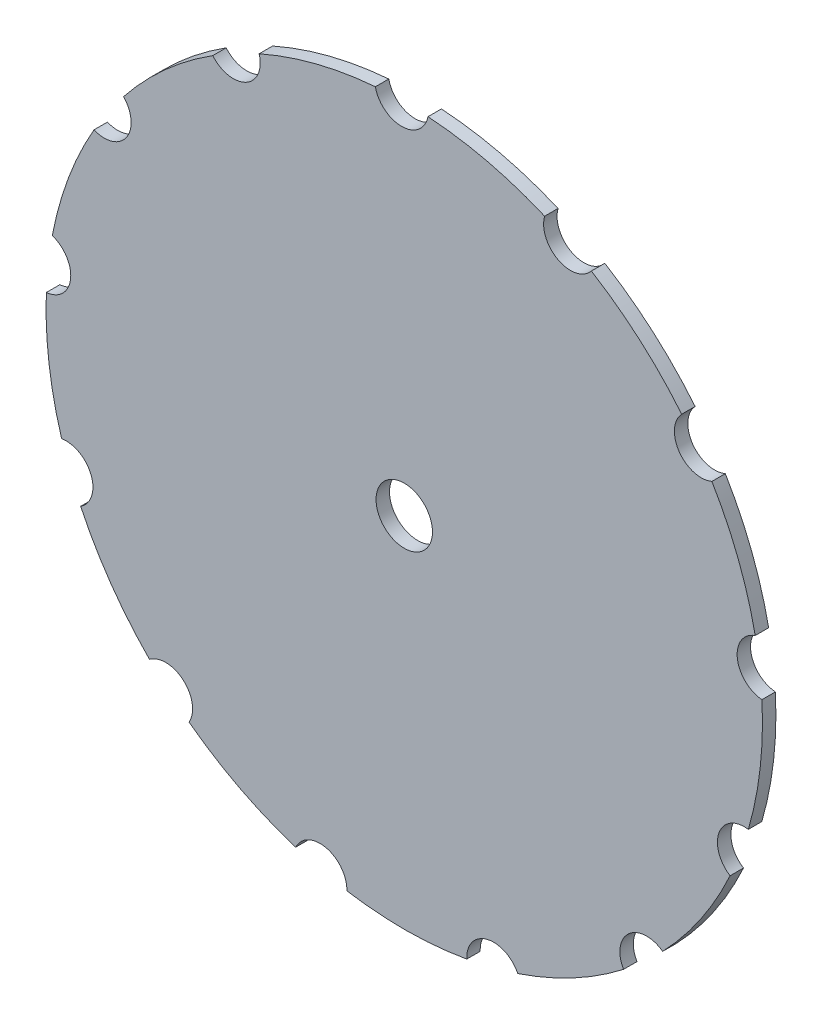
ISO-10303-21;
HEADER;
FILE_DESCRIPTION(('STEP AP214'),'2;1');
FILE_NAME('part.step','',(''),(''),'','','');
FILE_SCHEMA(('AUTOMOTIVE_DESIGN { 1 0 10303 214 1 1 1 1 }'));
ENDSEC;
DATA;
#1=APPLICATION_CONTEXT('core data for automotive mechanical design processes');
#2=APPLICATION_PROTOCOL_DEFINITION('international standard','automotive_design',2000,#1);
#3=PRODUCT_CONTEXT('',#1,'mechanical');
#4=PRODUCT('Part','Part','',(#3));
#5=PRODUCT_RELATED_PRODUCT_CATEGORY('part','',(#4));
#6=PRODUCT_DEFINITION_FORMATION('','',#4);
#7=PRODUCT_DEFINITION_CONTEXT('part definition',#1,'design');
#8=PRODUCT_DEFINITION('design','',#6,#7);
#9=PRODUCT_DEFINITION_SHAPE('','',#8);
#10=(LENGTH_UNIT() NAMED_UNIT(*) SI_UNIT(.MILLI.,.METRE.));
#11=(NAMED_UNIT(*) PLANE_ANGLE_UNIT() SI_UNIT($,.RADIAN.));
#12=(NAMED_UNIT(*) SI_UNIT($,.STERADIAN.) SOLID_ANGLE_UNIT());
#13=UNCERTAINTY_MEASURE_WITH_UNIT(LENGTH_MEASURE(1.E-05),#10,'distance_accuracy_value','');
#14=(GEOMETRIC_REPRESENTATION_CONTEXT(3) GLOBAL_UNCERTAINTY_ASSIGNED_CONTEXT((#13)) GLOBAL_UNIT_ASSIGNED_CONTEXT((#10,
#11,#12)) REPRESENTATION_CONTEXT('',''));
#15=CARTESIAN_POINT('',(0.,0.,0.));
#16=DIRECTION('',(0.,0.,1.));
#17=DIRECTION('',(1.,0.,0.));
#18=AXIS2_PLACEMENT_3D('',#15,#16,#17);
#19=CARTESIAN_POINT('',(-0.587373122348968,80.9978702980226,6.));
#20=DIRECTION('',(0.,0.,1.));
#21=DIRECTION('',(1.,0.,0.));
#22=AXIS2_PLACEMENT_3D('',#19,#20,#21);
#23=PLANE('',#22);
#24=CARTESIAN_POINT('',(0.,0.,6.));
#25=DIRECTION('',(0.,0.,1.));
#26=DIRECTION('',(1.,0.,0.));
#27=AXIS2_PLACEMENT_3D('',#24,#25,#26);
#28=CIRCLE('',#27,160.);
#29=CARTESIAN_POINT('',(62.6841029650331,147.209725342687,6.));
#30=VERTEX_POINT('',#29);
#31=CARTESIAN_POINT('',(10.5935341703109,159.648918047641,6.));
#32=VERTEX_POINT('',#31);
#33=EDGE_CURVE('E353',#30,#32,#28,.T.);
#34=ORIENTED_EDGE('',*,*,#33,.T.);
#35=CARTESIAN_POINT('',(-1.17474624469794,161.995740596045,6.));
#36=DIRECTION('',(0.,0.,-1.));
#37=DIRECTION('',(1.,0.,0.));
#38=AXIS2_PLACEMENT_3D('',#35,#36,#37);
#39=CIRCLE('',#38,11.999999999999);
#40=CARTESIAN_POINT('',(-12.9077538338865,159.478493506064,6.));
#41=VERTEX_POINT('',#40);
#42=EDGE_CURVE('E150',#32,#41,#39,.T.);
#43=ORIENTED_EDGE('',*,*,#42,.T.);
#44=CARTESIAN_POINT('',(0.,0.,6.));
#45=DIRECTION('',(0.,0.,1.));
#46=DIRECTION('',(1.,0.,0.));
#47=AXIS2_PLACEMENT_3D('',#44,#45,#46);
#48=CIRCLE('',#47,160.);
#49=CARTESIAN_POINT('',(-64.8124429443831,146.285157277084,6.));
#50=VERTEX_POINT('',#49);
#51=EDGE_CURVE('E347',#41,#50,#48,.T.);
#52=ORIENTED_EDGE('',*,*,#51,.T.);
#53=CARTESIAN_POINT('',(-76.323360568348,142.894172839742,6.));
#54=DIRECTION('',(0.,0.,-1.));
#55=DIRECTION('',(1.,0.,0.));
#56=AXIS2_PLACEMENT_3D('',#53,#54,#55);
#57=CIRCLE('',#56,12.);
#58=CARTESIAN_POINT('',(-85.5425997847584,135.2126607314,6.));
#59=VERTEX_POINT('',#58);
#60=EDGE_CURVE('E339',#50,#59,#57,.T.);
#61=ORIENTED_EDGE('',*,*,#60,.T.);
#62=CARTESIAN_POINT('',(0.,0.,6.));
#63=DIRECTION('',(0.,0.,1.));
#64=DIRECTION('',(1.,0.,0.));
#65=AXIS2_PLACEMENT_3D('',#62,#63,#64);
#66=CIRCLE('',#65,160.);
#67=CARTESIAN_POINT('',(-125.370670455135,99.4092299016034,6.));
#68=VERTEX_POINT('',#67);
#69=EDGE_CURVE('E335',#59,#68,#66,.T.);
#70=ORIENTED_EDGE('',*,*,#69,.T.);
#71=CARTESIAN_POINT('',(-133.987212781995,91.057272147319,6.));
#72=DIRECTION('',(0.,0.,-1.));
#73=DIRECTION('',(1.,0.,0.));
#74=AXIS2_PLACEMENT_3D('',#71,#72,#73);
#75=CIRCLE('',#74,11.999999999999);
#76=CARTESIAN_POINT('',(-138.580667025027,79.9712368723823,6.));
#77=VERTEX_POINT('',#76);
#78=EDGE_CURVE('E331',#68,#77,#75,.T.);
#79=ORIENTED_EDGE('',*,*,#78,.T.);
#80=CARTESIAN_POINT('',(0.,0.,6.));
#81=DIRECTION('',(0.,0.,1.));
#82=DIRECTION('',(1.,0.,0.));
#83=AXIS2_PLACEMENT_3D('',#80,#81,#82);
#84=CIRCLE('',#83,160.);
#85=CARTESIAN_POINT('',(-157.207988244983,29.7598459667596,6.));
#86=VERTEX_POINT('',#85);
#87=EDGE_CURVE('E328',#77,#86,#84,.T.);
#88=ORIENTED_EDGE('',*,*,#87,.T.);
#89=CARTESIAN_POINT('',(-160.956209268243,18.3602477650317,6.));
#90=DIRECTION('',(0.,0.,-1.));
#91=DIRECTION('',(1.,0.,0.));
#92=AXIS2_PLACEMENT_3D('',#89,#90,#91);
#93=CIRCLE('',#92,11.9999999999999);
#94=CARTESIAN_POINT('',(-159.871573527948,6.40936640377342,6.));
#95=VERTEX_POINT('',#94);
#96=EDGE_CURVE('E320',#86,#95,#93,.T.);
#97=ORIENTED_EDGE('',*,*,#96,.T.);
#98=CARTESIAN_POINT('',(0.,0.,6.));
#99=DIRECTION('',(0.,0.,1.));
#100=DIRECTION('',(1.,0.,0.));
#101=AXIS2_PLACEMENT_3D('',#98,#99,#100);
#102=CIRCLE('',#101,160.);
#103=CARTESIAN_POINT('',(-153.030850489544,-46.7071600340535,6.));
#104=VERTEX_POINT('',#103);
#105=EDGE_CURVE('E316',#95,#104,#102,.T.);
#106=ORIENTED_EDGE('',*,*,#105,.T.);
#107=CARTESIAN_POINT('',(-151.052077943734,-58.5428881152431,6.));
#108=DIRECTION('',(0.,0.,-1.));
#109=DIRECTION('',(1.,0.,0.));
#110=AXIS2_PLACEMENT_3D('',#107,#108,#109);
#111=CIRCLE('',#110,11.9999999999999);
#112=CARTESIAN_POINT('',(-144.537829196934,-68.6208126666975,6.));
#113=VERTEX_POINT('',#112);
#114=EDGE_CURVE('E312',#104,#113,#111,.T.);
#115=ORIENTED_EDGE('',*,*,#114,.T.);
#116=CARTESIAN_POINT('',(0.,0.,6.));
#117=DIRECTION('',(0.,0.,1.));
#118=DIRECTION('',(1.,0.,0.));
#119=AXIS2_PLACEMENT_3D('',#116,#117,#118);
#120=CIRCLE('',#119,160.);
#121=CARTESIAN_POINT('',(-113.796189108621,-112.474118553359,6.));
#122=VERTEX_POINT('',#121);
#123=EDGE_CURVE('E309',#113,#122,#120,.T.);
#124=ORIENTED_EDGE('',*,*,#123,.T.);
#125=CARTESIAN_POINT('',(-106.543735937192,-122.0345538466,6.));
#126=DIRECTION('',(0.,0.,-1.));
#127=DIRECTION('',(1.,0.,0.));
#128=AXIS2_PLACEMENT_3D('',#125,#126,#127);
#129=CIRCLE('',#128,12.0000000000017);
#130=CARTESIAN_POINT('',(-96.0922100665643,-127.930790525672,6.));
#131=VERTEX_POINT('',#130);
#132=EDGE_CURVE('E301',#122,#131,#129,.T.);
#133=ORIENTED_EDGE('',*,*,#132,.T.);
#134=CARTESIAN_POINT('',(0.,0.,6.));
#135=DIRECTION('',(0.,0.,1.));
#136=DIRECTION('',(1.,0.,0.));
#137=AXIS2_PLACEMENT_3D('',#134,#135,#136);
#138=CIRCLE('',#137,160.);
#139=CARTESIAN_POINT('',(-48.4921921956505,-152.474611972158,6.));
#140=VERTEX_POINT('',#139);
#141=EDGE_CURVE('E297',#131,#140,#138,.T.);
#142=ORIENTED_EDGE('',*,*,#141,.T.);
#143=CARTESIAN_POINT('',(-37.6275080186468,-157.569573967499,6.));
#144=DIRECTION('',(0.,0.,-1.));
#145=DIRECTION('',(1.,0.,0.));
#146=AXIS2_PLACEMENT_3D('',#143,#144,#145);
#147=CIRCLE('',#146,11.9999999999999);
#148=CARTESIAN_POINT('',(-25.6330236466115,-157.933366008365,6.));
#149=VERTEX_POINT('',#148);
#150=EDGE_CURVE('E293',#140,#149,#147,.T.);
#151=ORIENTED_EDGE('',*,*,#150,.T.);
#152=CARTESIAN_POINT('',(0.,0.,6.));
#153=DIRECTION('',(0.,0.,1.));
#154=DIRECTION('',(1.,0.,0.));
#155=AXIS2_PLACEMENT_3D('',#152,#153,#154);
#156=CIRCLE('',#155,160.);
#157=CARTESIAN_POINT('',(27.9207815550782,-157.5450093064,6.));
#158=VERTEX_POINT('',#157);
#159=EDGE_CURVE('E290',#149,#158,#156,.T.);
#160=ORIENTED_EDGE('',*,*,#159,.T.);
#161=CARTESIAN_POINT('',(39.9087285263425,-157.007303611659,6.));
#162=DIRECTION('',(0.,0.,-1.));
#163=DIRECTION('',(1.,0.,0.));
#164=AXIS2_PLACEMENT_3D('',#161,#162,#163);
#165=CIRCLE('',#164,12.0000000000001);
#166=CARTESIAN_POINT('',(50.6983795793594,-151.755310641925,6.));
#167=VERTEX_POINT('',#166);
#168=EDGE_CURVE('E282',#158,#167,#165,.T.);
#169=ORIENTED_EDGE('',*,*,#168,.T.);
#170=CARTESIAN_POINT('',(0.,0.,6.));
#171=DIRECTION('',(0.,0.,1.));
#172=DIRECTION('',(1.,0.,0.));
#173=AXIS2_PLACEMENT_3D('',#170,#171,#172);
#174=CIRCLE('',#173,160.);
#175=CARTESIAN_POINT('',(97.9374407334306,-126.523743631722,6.));
#176=VERTEX_POINT('',#175);
#177=EDGE_CURVE('E278',#167,#176,#174,.T.);
#178=ORIENTED_EDGE('',*,*,#177,.T.);
#179=CARTESIAN_POINT('',(108.302356318264,-120.476552141511,6.));
#180=DIRECTION('',(0.,0.,-1.));
#181=DIRECTION('',(1.,0.,0.));
#182=AXIS2_PLACEMENT_3D('',#179,#180,#181);
#183=CIRCLE('',#182,12.0000000000009);
#184=CARTESIAN_POINT('',(115.415395025404,-110.811942457165,6.));
#185=VERTEX_POINT('',#184);
#186=EDGE_CURVE('E274',#176,#185,#183,.T.);
#187=ORIENTED_EDGE('',*,*,#186,.T.);
#188=CARTESIAN_POINT('',(0.,0.,6.));
#189=DIRECTION('',(0.,0.,1.));
#190=DIRECTION('',(1.,0.,0.));
#191=AXIS2_PLACEMENT_3D('',#188,#189,#190);
#192=CIRCLE('',#191,160.);
#193=CARTESIAN_POINT('',(145.517812513859,-66.5174130674169,6.));
#194=VERTEX_POINT('',#193);
#195=EDGE_CURVE('E271',#185,#194,#192,.T.);
#196=ORIENTED_EDGE('',*,*,#195,.T.);
#197=CARTESIAN_POINT('',(151.885219462554,-56.3460744755864,6.));
#198=DIRECTION('',(0.,0.,-1.));
#199=DIRECTION('',(1.,0.,0.));
#200=AXIS2_PLACEMENT_3D('',#197,#198,#199);
#201=CIRCLE('',#200,11.9999999999987);
#202=CARTESIAN_POINT('',(153.692134377414,-44.482893684145,6.));
#203=VERTEX_POINT('',#202);
#204=EDGE_CURVE('E263',#194,#203,#201,.T.);
#205=ORIENTED_EDGE('',*,*,#204,.T.);
#206=CARTESIAN_POINT('',(0.,0.,6.));
#207=DIRECTION('',(0.,0.,1.));
#208=DIRECTION('',(1.,0.,0.));
#209=AXIS2_PLACEMENT_3D('',#206,#207,#208);
#210=CIRCLE('',#209,160.);
#211=CARTESIAN_POINT('',(159.761807127106,8.72725520889972,6.));
#212=VERTEX_POINT('',#211);
#213=EDGE_CURVE('E259',#203,#212,#210,.T.);
#214=ORIENTED_EDGE('',*,*,#213,.T.);
#215=CARTESIAN_POINT('',(160.673009243294,20.6926098088892,6.));
#216=DIRECTION('',(0.,0.,-1.));
#217=DIRECTION('',(1.,0.,0.));
#218=AXIS2_PLACEMENT_3D('',#215,#216,#217);
#219=CIRCLE('',#218,12.0000000000005);
#220=CARTESIAN_POINT('',(156.759857934566,32.036649954931,6.));
#221=VERTEX_POINT('',#220);
#222=EDGE_CURVE('E255',#212,#221,#219,.T.);
#223=ORIENTED_EDGE('',*,*,#222,.T.);
#224=CARTESIAN_POINT('',(0.,0.,6.));
#225=DIRECTION('',(0.,0.,1.));
#226=DIRECTION('',(1.,0.,0.));
#227=AXIS2_PLACEMENT_3D('',#224,#225,#226);
#228=CIRCLE('',#227,160.);
#229=CARTESIAN_POINT('',(137.406297066028,81.9726144916861,6.));
#230=VERTEX_POINT('',#229);
#231=EDGE_CURVE('E223',#221,#230,#228,.T.);
#232=ORIENTED_EDGE('',*,*,#231,.T.);
#233=CARTESIAN_POINT('',(132.652548926067,92.9908665591341,6.));
#234=DIRECTION('',(0.,0.,-1.));
#235=DIRECTION('',(1.,0.,0.));
#236=AXIS2_PLACEMENT_3D('',#233,#234,#235);
#237=CIRCLE('',#236,12.0000000000013);
#238=CARTESIAN_POINT('',(123.915787199994,101.216983172814,6.));
#239=VERTEX_POINT('',#238);
#240=EDGE_CURVE('E217',#230,#239,#237,.T.);
#241=ORIENTED_EDGE('',*,*,#240,.T.);
#242=CARTESIAN_POINT('',(0.,0.,6.));
#243=DIRECTION('',(0.,0.,1.));
#244=DIRECTION('',(1.,0.,0.));
#245=AXIS2_PLACEMENT_3D('',#242,#243,#244);
#246=CIRCLE('',#245,160.);
#247=CARTESIAN_POINT('',(83.5726602725145,136.439035671522,6.));
#248=VERTEX_POINT('',#247);
#249=EDGE_CURVE('E221',#239,#248,#246,.T.);
#250=ORIENTED_EDGE('',*,*,#249,.T.);
#251=CARTESIAN_POINT('',(74.24298828639,143.986036442111,6.));
#252=DIRECTION('',(0.,0.,-1.));
#253=DIRECTION('',(1.,0.,0.));
#254=AXIS2_PLACEMENT_3D('',#251,#252,#253);
#255=CIRCLE('',#254,11.999999999999);
#256=EDGE_CURVE('E53',#248,#30,#255,.T.);
#257=ORIENTED_EDGE('',*,*,#256,.T.);
#258=EDGE_LOOP('',(#34,#43,#52,#61,#70,#79,#88,#97,#106,#115,#124,#133,#142,#151,#160,#169,#178,
#187,#196,#205,#214,#223,#232,#241,#250,#257));
#259=FACE_BOUND('',#258,.T.);
#260=CARTESIAN_POINT('',(0.,0.,6.));
#261=DIRECTION('',(0.,0.,1.));
#262=DIRECTION('',(1.,0.,0.));
#263=AXIS2_PLACEMENT_3D('',#260,#261,#262);
#264=CIRCLE('',#263,12.6);
#265=CARTESIAN_POINT('',(12.6,0.,6.));
#266=VERTEX_POINT('',#265);
#267=EDGE_CURVE('E359',#266,#266,#264,.T.);
#268=ORIENTED_EDGE('',*,*,#267,.F.);
#269=EDGE_LOOP('',(#268));
#270=FACE_BOUND('',#269,.T.);
#271=ADVANCED_FACE('F36',(#259,#270),#23,.T.);
#272=CARTESIAN_POINT('',(-0.587373122348968,80.9978702980226,0.));
#273=DIRECTION('',(0.,0.,1.));
#274=DIRECTION('',(1.,0.,0.));
#275=AXIS2_PLACEMENT_3D('',#272,#273,#274);
#276=PLANE('',#275);
#277=CARTESIAN_POINT('',(0.,0.,0.));
#278=DIRECTION('',(0.,0.,1.));
#279=DIRECTION('',(1.,0.,0.));
#280=AXIS2_PLACEMENT_3D('',#277,#278,#279);
#281=CIRCLE('',#280,160.);
#282=CARTESIAN_POINT('',(62.6841029650331,147.209725342687,0.));
#283=VERTEX_POINT('',#282);
#284=CARTESIAN_POINT('',(10.5935341703109,159.648918047641,0.));
#285=VERTEX_POINT('',#284);
#286=EDGE_CURVE('E363',#283,#285,#281,.T.);
#287=ORIENTED_EDGE('',*,*,#286,.F.);
#288=CARTESIAN_POINT('',(74.24298828639,143.986036442111,0.));
#289=DIRECTION('',(0.,0.,-1.));
#290=DIRECTION('',(1.,0.,0.));
#291=AXIS2_PLACEMENT_3D('',#288,#289,#290);
#292=CIRCLE('',#291,11.999999999999);
#293=CARTESIAN_POINT('',(83.5726602725145,136.439035671522,0.));
#294=VERTEX_POINT('',#293);
#295=EDGE_CURVE('E142',#294,#283,#292,.T.);
#296=ORIENTED_EDGE('',*,*,#295,.F.);
#297=CARTESIAN_POINT('',(0.,0.,0.));
#298=DIRECTION('',(0.,0.,1.));
#299=DIRECTION('',(1.,0.,0.));
#300=AXIS2_PLACEMENT_3D('',#297,#298,#299);
#301=CIRCLE('',#300,160.);
#302=CARTESIAN_POINT('',(123.915787199994,101.216983172814,0.));
#303=VERTEX_POINT('',#302);
#304=EDGE_CURVE('E136',#303,#294,#301,.T.);
#305=ORIENTED_EDGE('',*,*,#304,.F.);
#306=CARTESIAN_POINT('',(132.652548926067,92.9908665591341,0.));
#307=DIRECTION('',(0.,0.,-1.));
#308=DIRECTION('',(1.,0.,0.));
#309=AXIS2_PLACEMENT_3D('',#306,#307,#308);
#310=CIRCLE('',#309,12.0000000000013);
#311=CARTESIAN_POINT('',(137.406297066028,81.9726144916861,0.));
#312=VERTEX_POINT('',#311);
#313=EDGE_CURVE('E232',#312,#303,#310,.T.);
#314=ORIENTED_EDGE('',*,*,#313,.F.);
#315=CARTESIAN_POINT('',(0.,0.,0.));
#316=DIRECTION('',(0.,0.,1.));
#317=DIRECTION('',(1.,0.,0.));
#318=AXIS2_PLACEMENT_3D('',#315,#316,#317);
#319=CIRCLE('',#318,160.);
#320=CARTESIAN_POINT('',(156.759857934566,32.036649954931,0.));
#321=VERTEX_POINT('',#320);
#322=EDGE_CURVE('E413',#321,#312,#319,.T.);
#323=ORIENTED_EDGE('',*,*,#322,.F.);
#324=CARTESIAN_POINT('',(160.673009243294,20.6926098088892,0.));
#325=DIRECTION('',(0.,0.,-1.));
#326=DIRECTION('',(1.,0.,0.));
#327=AXIS2_PLACEMENT_3D('',#324,#325,#326);
#328=CIRCLE('',#327,12.0000000000005);
#329=CARTESIAN_POINT('',(159.761807127106,8.72725520889972,0.));
#330=VERTEX_POINT('',#329);
#331=EDGE_CURVE('E411',#330,#321,#328,.T.);
#332=ORIENTED_EDGE('',*,*,#331,.F.);
#333=CARTESIAN_POINT('',(0.,0.,0.));
#334=DIRECTION('',(0.,0.,1.));
#335=DIRECTION('',(1.,0.,0.));
#336=AXIS2_PLACEMENT_3D('',#333,#334,#335);
#337=CIRCLE('',#336,160.);
#338=CARTESIAN_POINT('',(153.692134377414,-44.482893684145,0.));
#339=VERTEX_POINT('',#338);
#340=EDGE_CURVE('E409',#339,#330,#337,.T.);
#341=ORIENTED_EDGE('',*,*,#340,.F.);
#342=CARTESIAN_POINT('',(151.885219462554,-56.3460744755864,0.));
#343=DIRECTION('',(0.,0.,-1.));
#344=DIRECTION('',(1.,0.,0.));
#345=AXIS2_PLACEMENT_3D('',#342,#343,#344);
#346=CIRCLE('',#345,11.9999999999987);
#347=CARTESIAN_POINT('',(145.517812513859,-66.5174130674169,0.));
#348=VERTEX_POINT('',#347);
#349=EDGE_CURVE('E407',#348,#339,#346,.T.);
#350=ORIENTED_EDGE('',*,*,#349,.F.);
#351=CARTESIAN_POINT('',(0.,0.,0.));
#352=DIRECTION('',(0.,0.,1.));
#353=DIRECTION('',(1.,0.,0.));
#354=AXIS2_PLACEMENT_3D('',#351,#352,#353);
#355=CIRCLE('',#354,160.);
#356=CARTESIAN_POINT('',(115.415395025404,-110.811942457165,0.));
#357=VERTEX_POINT('',#356);
#358=EDGE_CURVE('E405',#357,#348,#355,.T.);
#359=ORIENTED_EDGE('',*,*,#358,.F.);
#360=CARTESIAN_POINT('',(108.302356318264,-120.476552141511,0.));
#361=DIRECTION('',(0.,0.,-1.));
#362=DIRECTION('',(1.,0.,0.));
#363=AXIS2_PLACEMENT_3D('',#360,#361,#362);
#364=CIRCLE('',#363,12.0000000000009);
#365=CARTESIAN_POINT('',(97.9374407334306,-126.523743631722,0.));
#366=VERTEX_POINT('',#365);
#367=EDGE_CURVE('E403',#366,#357,#364,.T.);
#368=ORIENTED_EDGE('',*,*,#367,.F.);
#369=CARTESIAN_POINT('',(0.,0.,0.));
#370=DIRECTION('',(0.,0.,1.));
#371=DIRECTION('',(1.,0.,0.));
#372=AXIS2_PLACEMENT_3D('',#369,#370,#371);
#373=CIRCLE('',#372,160.);
#374=CARTESIAN_POINT('',(50.6983795793594,-151.755310641925,0.));
#375=VERTEX_POINT('',#374);
#376=EDGE_CURVE('E401',#375,#366,#373,.T.);
#377=ORIENTED_EDGE('',*,*,#376,.F.);
#378=CARTESIAN_POINT('',(39.9087285263425,-157.007303611659,0.));
#379=DIRECTION('',(0.,0.,-1.));
#380=DIRECTION('',(1.,0.,0.));
#381=AXIS2_PLACEMENT_3D('',#378,#379,#380);
#382=CIRCLE('',#381,12.0000000000001);
#383=CARTESIAN_POINT('',(27.9207815550782,-157.5450093064,0.));
#384=VERTEX_POINT('',#383);
#385=EDGE_CURVE('E399',#384,#375,#382,.T.);
#386=ORIENTED_EDGE('',*,*,#385,.F.);
#387=CARTESIAN_POINT('',(0.,0.,0.));
#388=DIRECTION('',(0.,0.,1.));
#389=DIRECTION('',(1.,0.,0.));
#390=AXIS2_PLACEMENT_3D('',#387,#388,#389);
#391=CIRCLE('',#390,160.);
#392=CARTESIAN_POINT('',(-25.6330236466115,-157.933366008365,0.));
#393=VERTEX_POINT('',#392);
#394=EDGE_CURVE('E397',#393,#384,#391,.T.);
#395=ORIENTED_EDGE('',*,*,#394,.F.);
#396=CARTESIAN_POINT('',(-37.6275080186468,-157.569573967499,0.));
#397=DIRECTION('',(0.,0.,-1.));
#398=DIRECTION('',(1.,0.,0.));
#399=AXIS2_PLACEMENT_3D('',#396,#397,#398);
#400=CIRCLE('',#399,11.9999999999999);
#401=CARTESIAN_POINT('',(-48.4921921956505,-152.474611972158,0.));
#402=VERTEX_POINT('',#401);
#403=EDGE_CURVE('E395',#402,#393,#400,.T.);
#404=ORIENTED_EDGE('',*,*,#403,.F.);
#405=CARTESIAN_POINT('',(0.,0.,0.));
#406=DIRECTION('',(0.,0.,1.));
#407=DIRECTION('',(1.,0.,0.));
#408=AXIS2_PLACEMENT_3D('',#405,#406,#407);
#409=CIRCLE('',#408,160.);
#410=CARTESIAN_POINT('',(-96.0922100665643,-127.930790525672,0.));
#411=VERTEX_POINT('',#410);
#412=EDGE_CURVE('E393',#411,#402,#409,.T.);
#413=ORIENTED_EDGE('',*,*,#412,.F.);
#414=CARTESIAN_POINT('',(-106.543735937192,-122.0345538466,0.));
#415=DIRECTION('',(0.,0.,-1.));
#416=DIRECTION('',(1.,0.,0.));
#417=AXIS2_PLACEMENT_3D('',#414,#415,#416);
#418=CIRCLE('',#417,12.0000000000017);
#419=CARTESIAN_POINT('',(-113.796189108621,-112.474118553359,0.));
#420=VERTEX_POINT('',#419);
#421=EDGE_CURVE('E391',#420,#411,#418,.T.);
#422=ORIENTED_EDGE('',*,*,#421,.F.);
#423=CARTESIAN_POINT('',(0.,0.,0.));
#424=DIRECTION('',(0.,0.,1.));
#425=DIRECTION('',(1.,0.,0.));
#426=AXIS2_PLACEMENT_3D('',#423,#424,#425);
#427=CIRCLE('',#426,160.);
#428=CARTESIAN_POINT('',(-144.537829196934,-68.6208126666975,0.));
#429=VERTEX_POINT('',#428);
#430=EDGE_CURVE('E389',#429,#420,#427,.T.);
#431=ORIENTED_EDGE('',*,*,#430,.F.);
#432=CARTESIAN_POINT('',(-151.052077943734,-58.5428881152431,0.));
#433=DIRECTION('',(0.,0.,-1.));
#434=DIRECTION('',(1.,0.,0.));
#435=AXIS2_PLACEMENT_3D('',#432,#433,#434);
#436=CIRCLE('',#435,11.9999999999999);
#437=CARTESIAN_POINT('',(-153.030850489544,-46.7071600340535,0.));
#438=VERTEX_POINT('',#437);
#439=EDGE_CURVE('E387',#438,#429,#436,.T.);
#440=ORIENTED_EDGE('',*,*,#439,.F.);
#441=CARTESIAN_POINT('',(0.,0.,0.));
#442=DIRECTION('',(0.,0.,1.));
#443=DIRECTION('',(1.,0.,0.));
#444=AXIS2_PLACEMENT_3D('',#441,#442,#443);
#445=CIRCLE('',#444,160.);
#446=CARTESIAN_POINT('',(-159.871573527948,6.40936640377342,0.));
#447=VERTEX_POINT('',#446);
#448=EDGE_CURVE('E385',#447,#438,#445,.T.);
#449=ORIENTED_EDGE('',*,*,#448,.F.);
#450=CARTESIAN_POINT('',(-160.956209268243,18.3602477650317,0.));
#451=DIRECTION('',(0.,0.,-1.));
#452=DIRECTION('',(1.,0.,0.));
#453=AXIS2_PLACEMENT_3D('',#450,#451,#452);
#454=CIRCLE('',#453,11.9999999999999);
#455=CARTESIAN_POINT('',(-157.207988244983,29.7598459667596,0.));
#456=VERTEX_POINT('',#455);
#457=EDGE_CURVE('E383',#456,#447,#454,.T.);
#458=ORIENTED_EDGE('',*,*,#457,.F.);
#459=CARTESIAN_POINT('',(0.,0.,0.));
#460=DIRECTION('',(0.,0.,1.));
#461=DIRECTION('',(1.,0.,0.));
#462=AXIS2_PLACEMENT_3D('',#459,#460,#461);
#463=CIRCLE('',#462,160.);
#464=CARTESIAN_POINT('',(-138.580667025027,79.9712368723823,0.));
#465=VERTEX_POINT('',#464);
#466=EDGE_CURVE('E381',#465,#456,#463,.T.);
#467=ORIENTED_EDGE('',*,*,#466,.F.);
#468=CARTESIAN_POINT('',(-133.987212781995,91.057272147319,0.));
#469=DIRECTION('',(0.,0.,-1.));
#470=DIRECTION('',(1.,0.,0.));
#471=AXIS2_PLACEMENT_3D('',#468,#469,#470);
#472=CIRCLE('',#471,11.999999999999);
#473=CARTESIAN_POINT('',(-125.370670455135,99.4092299016034,0.));
#474=VERTEX_POINT('',#473);
#475=EDGE_CURVE('E379',#474,#465,#472,.T.);
#476=ORIENTED_EDGE('',*,*,#475,.F.);
#477=CARTESIAN_POINT('',(0.,0.,0.));
#478=DIRECTION('',(0.,0.,1.));
#479=DIRECTION('',(1.,0.,0.));
#480=AXIS2_PLACEMENT_3D('',#477,#478,#479);
#481=CIRCLE('',#480,160.);
#482=CARTESIAN_POINT('',(-85.5425997847584,135.2126607314,0.));
#483=VERTEX_POINT('',#482);
#484=EDGE_CURVE('E377',#483,#474,#481,.T.);
#485=ORIENTED_EDGE('',*,*,#484,.F.);
#486=CARTESIAN_POINT('',(-76.323360568348,142.894172839742,0.));
#487=DIRECTION('',(0.,0.,-1.));
#488=DIRECTION('',(1.,0.,0.));
#489=AXIS2_PLACEMENT_3D('',#486,#487,#488);
#490=CIRCLE('',#489,12.);
#491=CARTESIAN_POINT('',(-64.8124429443831,146.285157277084,0.));
#492=VERTEX_POINT('',#491);
#493=EDGE_CURVE('E375',#492,#483,#490,.T.);
#494=ORIENTED_EDGE('',*,*,#493,.F.);
#495=CARTESIAN_POINT('',(0.,0.,0.));
#496=DIRECTION('',(0.,0.,1.));
#497=DIRECTION('',(1.,0.,0.));
#498=AXIS2_PLACEMENT_3D('',#495,#496,#497);
#499=CIRCLE('',#498,160.);
#500=CARTESIAN_POINT('',(-12.9077538338865,159.478493506064,0.));
#501=VERTEX_POINT('',#500);
#502=EDGE_CURVE('E371',#501,#492,#499,.T.);
#503=ORIENTED_EDGE('',*,*,#502,.F.);
#504=CARTESIAN_POINT('',(-1.17474624469794,161.995740596045,0.));
#505=DIRECTION('',(0.,0.,-1.));
#506=DIRECTION('',(1.,0.,0.));
#507=AXIS2_PLACEMENT_3D('',#504,#505,#506);
#508=CIRCLE('',#507,11.999999999999);
#509=EDGE_CURVE('E367',#285,#501,#508,.T.);
#510=ORIENTED_EDGE('',*,*,#509,.F.);
#511=EDGE_LOOP('',(#287,#296,#305,#314,#323,#332,#341,#350,#359,#368,#377,#386,#395,#404,#413,
#422,#431,#440,#449,#458,#467,#476,#485,#494,#503,#510));
#512=FACE_BOUND('',#511,.T.);
#513=CARTESIAN_POINT('',(0.,0.,0.));
#514=DIRECTION('',(0.,0.,1.));
#515=DIRECTION('',(1.,0.,0.));
#516=AXIS2_PLACEMENT_3D('',#513,#514,#515);
#517=CIRCLE('',#516,12.6);
#518=CARTESIAN_POINT('',(12.6,0.,0.));
#519=VERTEX_POINT('',#518);
#520=EDGE_CURVE('E357',#519,#519,#517,.T.);
#521=ORIENTED_EDGE('',*,*,#520,.T.);
#522=EDGE_LOOP('',(#521));
#523=FACE_BOUND('',#522,.T.);
#524=ADVANCED_FACE('F488',(#512,#523),#276,.F.);
#525=CARTESIAN_POINT('',(0.,0.,6.));
#526=DIRECTION('',(0.,0.,-1.));
#527=DIRECTION('',(-1.,0.,0.));
#528=AXIS2_PLACEMENT_3D('',#525,#526,#527);
#529=CYLINDRICAL_SURFACE('',#528,160.);
#530=ORIENTED_EDGE('',*,*,#286,.T.);
#531=DIRECTION('',(0.,0.,-1.));
#532=VECTOR('',#531,1.);
#533=CARTESIAN_POINT('',(10.5935341703109,159.648918047641,6.));
#534=LINE('',#533,#532);
#535=EDGE_CURVE('E12',#32,#285,#534,.T.);
#536=ORIENTED_EDGE('',*,*,#535,.F.);
#537=ORIENTED_EDGE('',*,*,#33,.F.);
#538=DIRECTION('',(0.,0.,-1.));
#539=VECTOR('',#538,1.);
#540=CARTESIAN_POINT('',(62.6841029650331,147.209725342687,6.));
#541=LINE('',#540,#539);
#542=EDGE_CURVE('E240',#30,#283,#541,.T.);
#543=ORIENTED_EDGE('',*,*,#542,.T.);
#544=EDGE_LOOP('',(#530,#536,#537,#543));
#545=FACE_BOUND('',#544,.T.);
#546=ADVANCED_FACE('F38',(#545),#529,.T.);
#547=CARTESIAN_POINT('',(-1.17474624469794,161.995740596045,6.));
#548=DIRECTION('',(0.,0.,-1.));
#549=DIRECTION('',(-1.,0.,0.));
#550=AXIS2_PLACEMENT_3D('',#547,#548,#549);
#551=CYLINDRICAL_SURFACE('',#550,11.999999999999);
#552=ORIENTED_EDGE('',*,*,#509,.T.);
#553=DIRECTION('',(0.,0.,-1.));
#554=VECTOR('',#553,1.);
#555=CARTESIAN_POINT('',(-12.9077538338865,159.478493506064,6.));
#556=LINE('',#555,#554);
#557=EDGE_CURVE('E45',#41,#501,#556,.T.);
#558=ORIENTED_EDGE('',*,*,#557,.F.);
#559=ORIENTED_EDGE('',*,*,#42,.F.);
#560=ORIENTED_EDGE('',*,*,#535,.T.);
#561=EDGE_LOOP('',(#552,#558,#559,#560));
#562=FACE_BOUND('',#561,.T.);
#563=ADVANCED_FACE('F796',(#562),#551,.F.);
#564=CARTESIAN_POINT('',(0.,0.,6.));
#565=DIRECTION('',(0.,0.,-1.));
#566=DIRECTION('',(-1.,0.,0.));
#567=AXIS2_PLACEMENT_3D('',#564,#565,#566);
#568=CYLINDRICAL_SURFACE('',#567,160.);
#569=ORIENTED_EDGE('',*,*,#502,.T.);
#570=DIRECTION('',(0.,0.,-1.));
#571=VECTOR('',#570,1.);
#572=CARTESIAN_POINT('',(-64.8124429443831,146.285157277084,6.));
#573=LINE('',#572,#571);
#574=EDGE_CURVE('E478',#50,#492,#573,.T.);
#575=ORIENTED_EDGE('',*,*,#574,.F.);
#576=ORIENTED_EDGE('',*,*,#51,.F.);
#577=ORIENTED_EDGE('',*,*,#557,.T.);
#578=EDGE_LOOP('',(#569,#575,#576,#577));
#579=FACE_BOUND('',#578,.T.);
#580=ADVANCED_FACE('F484',(#579),#568,.T.);
#581=CARTESIAN_POINT('',(-76.323360568348,142.894172839742,6.));
#582=DIRECTION('',(0.,0.,-1.));
#583=DIRECTION('',(-1.,0.,0.));
#584=AXIS2_PLACEMENT_3D('',#581,#582,#583);
#585=CYLINDRICAL_SURFACE('',#584,12.);
#586=ORIENTED_EDGE('',*,*,#493,.T.);
#587=DIRECTION('',(0.,0.,-1.));
#588=VECTOR('',#587,1.);
#589=CARTESIAN_POINT('',(-85.5425997847584,135.2126607314,6.));
#590=LINE('',#589,#588);
#591=EDGE_CURVE('E475',#59,#483,#590,.T.);
#592=ORIENTED_EDGE('',*,*,#591,.F.);
#593=ORIENTED_EDGE('',*,*,#60,.F.);
#594=ORIENTED_EDGE('',*,*,#574,.T.);
#595=EDGE_LOOP('',(#586,#592,#593,#594));
#596=FACE_BOUND('',#595,.T.);
#597=ADVANCED_FACE('F494',(#596),#585,.F.);
#598=CARTESIAN_POINT('',(0.,0.,6.));
#599=DIRECTION('',(0.,0.,-1.));
#600=DIRECTION('',(-1.,0.,0.));
#601=AXIS2_PLACEMENT_3D('',#598,#599,#600);
#602=CYLINDRICAL_SURFACE('',#601,160.);
#603=ORIENTED_EDGE('',*,*,#484,.T.);
#604=DIRECTION('',(0.,0.,-1.));
#605=VECTOR('',#604,1.);
#606=CARTESIAN_POINT('',(-125.370670455135,99.4092299016034,6.));
#607=LINE('',#606,#605);
#608=EDGE_CURVE('E472',#68,#474,#607,.T.);
#609=ORIENTED_EDGE('',*,*,#608,.F.);
#610=ORIENTED_EDGE('',*,*,#69,.F.);
#611=ORIENTED_EDGE('',*,*,#591,.T.);
#612=EDGE_LOOP('',(#603,#609,#610,#611));
#613=FACE_BOUND('',#612,.T.);
#614=ADVANCED_FACE('F498',(#613),#602,.T.);
#615=CARTESIAN_POINT('',(-133.987212781995,91.057272147319,6.));
#616=DIRECTION('',(0.,0.,-1.));
#617=DIRECTION('',(-1.,0.,0.));
#618=AXIS2_PLACEMENT_3D('',#615,#616,#617);
#619=CYLINDRICAL_SURFACE('',#618,11.999999999999);
#620=ORIENTED_EDGE('',*,*,#475,.T.);
#621=DIRECTION('',(0.,0.,-1.));
#622=VECTOR('',#621,1.);
#623=CARTESIAN_POINT('',(-138.580667025027,79.9712368723823,6.));
#624=LINE('',#623,#622);
#625=EDGE_CURVE('E469',#77,#465,#624,.T.);
#626=ORIENTED_EDGE('',*,*,#625,.F.);
#627=ORIENTED_EDGE('',*,*,#78,.F.);
#628=ORIENTED_EDGE('',*,*,#608,.T.);
#629=EDGE_LOOP('',(#620,#626,#627,#628));
#630=FACE_BOUND('',#629,.T.);
#631=ADVANCED_FACE('F591',(#630),#619,.F.);
#632=CARTESIAN_POINT('',(0.,0.,6.));
#633=DIRECTION('',(0.,0.,-1.));
#634=DIRECTION('',(-1.,0.,0.));
#635=AXIS2_PLACEMENT_3D('',#632,#633,#634);
#636=CYLINDRICAL_SURFACE('',#635,160.);
#637=ORIENTED_EDGE('',*,*,#466,.T.);
#638=DIRECTION('',(0.,0.,-1.));
#639=VECTOR('',#638,1.);
#640=CARTESIAN_POINT('',(-157.207988244983,29.7598459667596,6.));
#641=LINE('',#640,#639);
#642=EDGE_CURVE('E466',#86,#456,#641,.T.);
#643=ORIENTED_EDGE('',*,*,#642,.F.);
#644=ORIENTED_EDGE('',*,*,#87,.F.);
#645=ORIENTED_EDGE('',*,*,#625,.T.);
#646=EDGE_LOOP('',(#637,#643,#644,#645));
#647=FACE_BOUND('',#646,.T.);
#648=ADVANCED_FACE('F588',(#647),#636,.T.);
#649=CARTESIAN_POINT('',(-160.956209268243,18.3602477650317,6.));
#650=DIRECTION('',(0.,0.,-1.));
#651=DIRECTION('',(-1.,0.,0.));
#652=AXIS2_PLACEMENT_3D('',#649,#650,#651);
#653=CYLINDRICAL_SURFACE('',#652,11.9999999999999);
#654=ORIENTED_EDGE('',*,*,#457,.T.);
#655=DIRECTION('',(0.,0.,-1.));
#656=VECTOR('',#655,1.);
#657=CARTESIAN_POINT('',(-159.871573527948,6.40936640377342,6.));
#658=LINE('',#657,#656);
#659=EDGE_CURVE('E463',#95,#447,#658,.T.);
#660=ORIENTED_EDGE('',*,*,#659,.F.);
#661=ORIENTED_EDGE('',*,*,#96,.F.);
#662=ORIENTED_EDGE('',*,*,#642,.T.);
#663=EDGE_LOOP('',(#654,#660,#661,#662));
#664=FACE_BOUND('',#663,.T.);
#665=ADVANCED_FACE('F584',(#664),#653,.F.);
#666=CARTESIAN_POINT('',(0.,0.,6.));
#667=DIRECTION('',(0.,0.,-1.));
#668=DIRECTION('',(-1.,0.,0.));
#669=AXIS2_PLACEMENT_3D('',#666,#667,#668);
#670=CYLINDRICAL_SURFACE('',#669,160.);
#671=ORIENTED_EDGE('',*,*,#448,.T.);
#672=DIRECTION('',(0.,0.,-1.));
#673=VECTOR('',#672,1.);
#674=CARTESIAN_POINT('',(-153.030850489544,-46.7071600340535,6.));
#675=LINE('',#674,#673);
#676=EDGE_CURVE('E460',#104,#438,#675,.T.);
#677=ORIENTED_EDGE('',*,*,#676,.F.);
#678=ORIENTED_EDGE('',*,*,#105,.F.);
#679=ORIENTED_EDGE('',*,*,#659,.T.);
#680=EDGE_LOOP('',(#671,#677,#678,#679));
#681=FACE_BOUND('',#680,.T.);
#682=ADVANCED_FACE('F580',(#681),#670,.T.);
#683=CARTESIAN_POINT('',(-151.052077943734,-58.5428881152431,6.));
#684=DIRECTION('',(0.,0.,-1.));
#685=DIRECTION('',(-1.,0.,0.));
#686=AXIS2_PLACEMENT_3D('',#683,#684,#685);
#687=CYLINDRICAL_SURFACE('',#686,11.9999999999999);
#688=ORIENTED_EDGE('',*,*,#439,.T.);
#689=DIRECTION('',(0.,0.,-1.));
#690=VECTOR('',#689,1.);
#691=CARTESIAN_POINT('',(-144.537829196934,-68.6208126666975,6.));
#692=LINE('',#691,#690);
#693=EDGE_CURVE('E457',#113,#429,#692,.T.);
#694=ORIENTED_EDGE('',*,*,#693,.F.);
#695=ORIENTED_EDGE('',*,*,#114,.F.);
#696=ORIENTED_EDGE('',*,*,#676,.T.);
#697=EDGE_LOOP('',(#688,#694,#695,#696));
#698=FACE_BOUND('',#697,.T.);
#699=ADVANCED_FACE('F575',(#698),#687,.F.);
#700=CARTESIAN_POINT('',(0.,0.,6.));
#701=DIRECTION('',(0.,0.,-1.));
#702=DIRECTION('',(-1.,0.,0.));
#703=AXIS2_PLACEMENT_3D('',#700,#701,#702);
#704=CYLINDRICAL_SURFACE('',#703,160.);
#705=ORIENTED_EDGE('',*,*,#430,.T.);
#706=DIRECTION('',(0.,0.,-1.));
#707=VECTOR('',#706,1.);
#708=CARTESIAN_POINT('',(-113.796189108621,-112.474118553359,6.));
#709=LINE('',#708,#707);
#710=EDGE_CURVE('E454',#122,#420,#709,.T.);
#711=ORIENTED_EDGE('',*,*,#710,.F.);
#712=ORIENTED_EDGE('',*,*,#123,.F.);
#713=ORIENTED_EDGE('',*,*,#693,.T.);
#714=EDGE_LOOP('',(#705,#711,#712,#713));
#715=FACE_BOUND('',#714,.T.);
#716=ADVANCED_FACE('F569',(#715),#704,.T.);
#717=CARTESIAN_POINT('',(-106.543735937192,-122.0345538466,6.));
#718=DIRECTION('',(0.,0.,-1.));
#719=DIRECTION('',(-1.,0.,0.));
#720=AXIS2_PLACEMENT_3D('',#717,#718,#719);
#721=CYLINDRICAL_SURFACE('',#720,12.0000000000017);
#722=ORIENTED_EDGE('',*,*,#421,.T.);
#723=DIRECTION('',(0.,0.,-1.));
#724=VECTOR('',#723,1.);
#725=CARTESIAN_POINT('',(-96.0922100665643,-127.930790525672,6.));
#726=LINE('',#725,#724);
#727=EDGE_CURVE('E451',#131,#411,#726,.T.);
#728=ORIENTED_EDGE('',*,*,#727,.F.);
#729=ORIENTED_EDGE('',*,*,#132,.F.);
#730=ORIENTED_EDGE('',*,*,#710,.T.);
#731=EDGE_LOOP('',(#722,#728,#729,#730));
#732=FACE_BOUND('',#731,.T.);
#733=ADVANCED_FACE('F565',(#732),#721,.F.);
#734=CARTESIAN_POINT('',(0.,0.,6.));
#735=DIRECTION('',(0.,0.,-1.));
#736=DIRECTION('',(-1.,0.,0.));
#737=AXIS2_PLACEMENT_3D('',#734,#735,#736);
#738=CYLINDRICAL_SURFACE('',#737,160.);
#739=ORIENTED_EDGE('',*,*,#412,.T.);
#740=DIRECTION('',(0.,0.,-1.));
#741=VECTOR('',#740,1.);
#742=CARTESIAN_POINT('',(-48.4921921956505,-152.474611972158,6.));
#743=LINE('',#742,#741);
#744=EDGE_CURVE('E448',#140,#402,#743,.T.);
#745=ORIENTED_EDGE('',*,*,#744,.F.);
#746=ORIENTED_EDGE('',*,*,#141,.F.);
#747=ORIENTED_EDGE('',*,*,#727,.T.);
#748=EDGE_LOOP('',(#739,#745,#746,#747));
#749=FACE_BOUND('',#748,.T.);
#750=ADVANCED_FACE('F560',(#749),#738,.T.);
#751=CARTESIAN_POINT('',(-37.6275080186468,-157.569573967499,6.));
#752=DIRECTION('',(0.,0.,-1.));
#753=DIRECTION('',(-1.,0.,0.));
#754=AXIS2_PLACEMENT_3D('',#751,#752,#753);
#755=CYLINDRICAL_SURFACE('',#754,11.9999999999999);
#756=ORIENTED_EDGE('',*,*,#403,.T.);
#757=DIRECTION('',(0.,0.,-1.));
#758=VECTOR('',#757,1.);
#759=CARTESIAN_POINT('',(-25.6330236466115,-157.933366008365,6.));
#760=LINE('',#759,#758);
#761=EDGE_CURVE('E445',#149,#393,#760,.T.);
#762=ORIENTED_EDGE('',*,*,#761,.F.);
#763=ORIENTED_EDGE('',*,*,#150,.F.);
#764=ORIENTED_EDGE('',*,*,#744,.T.);
#765=EDGE_LOOP('',(#756,#762,#763,#764));
#766=FACE_BOUND('',#765,.T.);
#767=ADVANCED_FACE('F554',(#766),#755,.F.);
#768=CARTESIAN_POINT('',(0.,0.,6.));
#769=DIRECTION('',(0.,0.,-1.));
#770=DIRECTION('',(-1.,0.,0.));
#771=AXIS2_PLACEMENT_3D('',#768,#769,#770);
#772=CYLINDRICAL_SURFACE('',#771,160.);
#773=ORIENTED_EDGE('',*,*,#394,.T.);
#774=DIRECTION('',(0.,0.,-1.));
#775=VECTOR('',#774,1.);
#776=CARTESIAN_POINT('',(27.9207815550782,-157.5450093064,6.));
#777=LINE('',#776,#775);
#778=EDGE_CURVE('E442',#158,#384,#777,.T.);
#779=ORIENTED_EDGE('',*,*,#778,.F.);
#780=ORIENTED_EDGE('',*,*,#159,.F.);
#781=ORIENTED_EDGE('',*,*,#761,.T.);
#782=EDGE_LOOP('',(#773,#779,#780,#781));
#783=FACE_BOUND('',#782,.T.);
#784=ADVANCED_FACE('F550',(#783),#772,.T.);
#785=CARTESIAN_POINT('',(39.9087285263425,-157.007303611659,6.));
#786=DIRECTION('',(0.,0.,-1.));
#787=DIRECTION('',(-1.,0.,0.));
#788=AXIS2_PLACEMENT_3D('',#785,#786,#787);
#789=CYLINDRICAL_SURFACE('',#788,12.0000000000001);
#790=ORIENTED_EDGE('',*,*,#385,.T.);
#791=DIRECTION('',(0.,0.,-1.));
#792=VECTOR('',#791,1.);
#793=CARTESIAN_POINT('',(50.6983795793594,-151.755310641925,6.));
#794=LINE('',#793,#792);
#795=EDGE_CURVE('E439',#167,#375,#794,.T.);
#796=ORIENTED_EDGE('',*,*,#795,.F.);
#797=ORIENTED_EDGE('',*,*,#168,.F.);
#798=ORIENTED_EDGE('',*,*,#778,.T.);
#799=EDGE_LOOP('',(#790,#796,#797,#798));
#800=FACE_BOUND('',#799,.T.);
#801=ADVANCED_FACE('F545',(#800),#789,.F.);
#802=CARTESIAN_POINT('',(0.,0.,6.));
#803=DIRECTION('',(0.,0.,-1.));
#804=DIRECTION('',(-1.,0.,0.));
#805=AXIS2_PLACEMENT_3D('',#802,#803,#804);
#806=CYLINDRICAL_SURFACE('',#805,160.);
#807=ORIENTED_EDGE('',*,*,#376,.T.);
#808=DIRECTION('',(0.,0.,-1.));
#809=VECTOR('',#808,1.);
#810=CARTESIAN_POINT('',(97.9374407334306,-126.523743631722,6.));
#811=LINE('',#810,#809);
#812=EDGE_CURVE('E436',#176,#366,#811,.T.);
#813=ORIENTED_EDGE('',*,*,#812,.F.);
#814=ORIENTED_EDGE('',*,*,#177,.F.);
#815=ORIENTED_EDGE('',*,*,#795,.T.);
#816=EDGE_LOOP('',(#807,#813,#814,#815));
#817=FACE_BOUND('',#816,.T.);
#818=ADVANCED_FACE('F539',(#817),#806,.T.);
#819=CARTESIAN_POINT('',(108.302356318264,-120.476552141511,6.));
#820=DIRECTION('',(0.,0.,-1.));
#821=DIRECTION('',(-1.,0.,0.));
#822=AXIS2_PLACEMENT_3D('',#819,#820,#821);
#823=CYLINDRICAL_SURFACE('',#822,12.0000000000009);
#824=ORIENTED_EDGE('',*,*,#367,.T.);
#825=DIRECTION('',(0.,0.,-1.));
#826=VECTOR('',#825,1.);
#827=CARTESIAN_POINT('',(115.415395025404,-110.811942457165,6.));
#828=LINE('',#827,#826);
#829=EDGE_CURVE('E433',#185,#357,#828,.T.);
#830=ORIENTED_EDGE('',*,*,#829,.F.);
#831=ORIENTED_EDGE('',*,*,#186,.F.);
#832=ORIENTED_EDGE('',*,*,#812,.T.);
#833=EDGE_LOOP('',(#824,#830,#831,#832));
#834=FACE_BOUND('',#833,.T.);
#835=ADVANCED_FACE('F535',(#834),#823,.F.);
#836=CARTESIAN_POINT('',(0.,0.,6.));
#837=DIRECTION('',(0.,0.,-1.));
#838=DIRECTION('',(-1.,0.,0.));
#839=AXIS2_PLACEMENT_3D('',#836,#837,#838);
#840=CYLINDRICAL_SURFACE('',#839,160.);
#841=ORIENTED_EDGE('',*,*,#358,.T.);
#842=DIRECTION('',(0.,0.,-1.));
#843=VECTOR('',#842,1.);
#844=CARTESIAN_POINT('',(145.517812513859,-66.5174130674169,6.));
#845=LINE('',#844,#843);
#846=EDGE_CURVE('E430',#194,#348,#845,.T.);
#847=ORIENTED_EDGE('',*,*,#846,.F.);
#848=ORIENTED_EDGE('',*,*,#195,.F.);
#849=ORIENTED_EDGE('',*,*,#829,.T.);
#850=EDGE_LOOP('',(#841,#847,#848,#849));
#851=FACE_BOUND('',#850,.T.);
#852=ADVANCED_FACE('F531',(#851),#840,.T.);
#853=CARTESIAN_POINT('',(151.885219462554,-56.3460744755864,6.));
#854=DIRECTION('',(0.,0.,-1.));
#855=DIRECTION('',(-1.,0.,0.));
#856=AXIS2_PLACEMENT_3D('',#853,#854,#855);
#857=CYLINDRICAL_SURFACE('',#856,11.9999999999987);
#858=ORIENTED_EDGE('',*,*,#349,.T.);
#859=DIRECTION('',(0.,0.,-1.));
#860=VECTOR('',#859,1.);
#861=CARTESIAN_POINT('',(153.692134377414,-44.482893684145,6.));
#862=LINE('',#861,#860);
#863=EDGE_CURVE('E427',#203,#339,#862,.T.);
#864=ORIENTED_EDGE('',*,*,#863,.F.);
#865=ORIENTED_EDGE('',*,*,#204,.F.);
#866=ORIENTED_EDGE('',*,*,#846,.T.);
#867=EDGE_LOOP('',(#858,#864,#865,#866));
#868=FACE_BOUND('',#867,.T.);
#869=ADVANCED_FACE('F514',(#868),#857,.F.);
#870=CARTESIAN_POINT('',(0.,0.,6.));
#871=DIRECTION('',(0.,0.,-1.));
#872=DIRECTION('',(-1.,0.,0.));
#873=AXIS2_PLACEMENT_3D('',#870,#871,#872);
#874=CYLINDRICAL_SURFACE('',#873,160.);
#875=ORIENTED_EDGE('',*,*,#340,.T.);
#876=DIRECTION('',(0.,0.,-1.));
#877=VECTOR('',#876,1.);
#878=CARTESIAN_POINT('',(159.761807127106,8.72725520889972,6.));
#879=LINE('',#878,#877);
#880=EDGE_CURVE('E424',#212,#330,#879,.T.);
#881=ORIENTED_EDGE('',*,*,#880,.F.);
#882=ORIENTED_EDGE('',*,*,#213,.F.);
#883=ORIENTED_EDGE('',*,*,#863,.T.);
#884=EDGE_LOOP('',(#875,#881,#882,#883));
#885=FACE_BOUND('',#884,.T.);
#886=ADVANCED_FACE('F518',(#885),#874,.T.);
#887=CARTESIAN_POINT('',(160.673009243294,20.6926098088892,6.));
#888=DIRECTION('',(0.,0.,-1.));
#889=DIRECTION('',(-1.,0.,0.));
#890=AXIS2_PLACEMENT_3D('',#887,#888,#889);
#891=CYLINDRICAL_SURFACE('',#890,12.0000000000005);
#892=ORIENTED_EDGE('',*,*,#331,.T.);
#893=DIRECTION('',(0.,0.,-1.));
#894=VECTOR('',#893,1.);
#895=CARTESIAN_POINT('',(156.759857934566,32.036649954931,6.));
#896=LINE('',#895,#894);
#897=EDGE_CURVE('E421',#221,#321,#896,.T.);
#898=ORIENTED_EDGE('',*,*,#897,.F.);
#899=ORIENTED_EDGE('',*,*,#222,.F.);
#900=ORIENTED_EDGE('',*,*,#880,.T.);
#901=EDGE_LOOP('',(#892,#898,#899,#900));
#902=FACE_BOUND('',#901,.T.);
#903=ADVANCED_FACE('F523',(#902),#891,.F.);
#904=CARTESIAN_POINT('',(0.,0.,6.));
#905=DIRECTION('',(0.,0.,-1.));
#906=DIRECTION('',(-1.,0.,0.));
#907=AXIS2_PLACEMENT_3D('',#904,#905,#906);
#908=CYLINDRICAL_SURFACE('',#907,160.);
#909=ORIENTED_EDGE('',*,*,#322,.T.);
#910=DIRECTION('',(0.,0.,-1.));
#911=VECTOR('',#910,1.);
#912=CARTESIAN_POINT('',(137.406297066028,81.9726144916861,6.));
#913=LINE('',#912,#911);
#914=EDGE_CURVE('E233',#230,#312,#913,.T.);
#915=ORIENTED_EDGE('',*,*,#914,.F.);
#916=ORIENTED_EDGE('',*,*,#231,.F.);
#917=ORIENTED_EDGE('',*,*,#897,.T.);
#918=EDGE_LOOP('',(#909,#915,#916,#917));
#919=FACE_BOUND('',#918,.T.);
#920=ADVANCED_FACE('F526',(#919),#908,.T.);
#921=CARTESIAN_POINT('',(132.652548926067,92.9908665591341,6.));
#922=DIRECTION('',(0.,0.,-1.));
#923=DIRECTION('',(-1.,0.,0.));
#924=AXIS2_PLACEMENT_3D('',#921,#922,#923);
#925=CYLINDRICAL_SURFACE('',#924,12.0000000000013);
#926=ORIENTED_EDGE('',*,*,#313,.T.);
#927=DIRECTION('',(0.,0.,-1.));
#928=VECTOR('',#927,1.);
#929=CARTESIAN_POINT('',(123.915787199994,101.216983172814,6.));
#930=LINE('',#929,#928);
#931=EDGE_CURVE('E229',#239,#303,#930,.T.);
#932=ORIENTED_EDGE('',*,*,#931,.F.);
#933=ORIENTED_EDGE('',*,*,#240,.F.);
#934=ORIENTED_EDGE('',*,*,#914,.T.);
#935=EDGE_LOOP('',(#926,#932,#933,#934));
#936=FACE_BOUND('',#935,.T.);
#937=ADVANCED_FACE('F230',(#936),#925,.F.);
#938=CARTESIAN_POINT('',(0.,0.,6.));
#939=DIRECTION('',(0.,0.,-1.));
#940=DIRECTION('',(-1.,0.,0.));
#941=AXIS2_PLACEMENT_3D('',#938,#939,#940);
#942=CYLINDRICAL_SURFACE('',#941,160.);
#943=ORIENTED_EDGE('',*,*,#304,.T.);
#944=DIRECTION('',(0.,0.,-1.));
#945=VECTOR('',#944,1.);
#946=CARTESIAN_POINT('',(83.5726602725145,136.439035671522,6.));
#947=LINE('',#946,#945);
#948=EDGE_CURVE('E234',#248,#294,#947,.T.);
#949=ORIENTED_EDGE('',*,*,#948,.F.);
#950=ORIENTED_EDGE('',*,*,#249,.F.);
#951=ORIENTED_EDGE('',*,*,#931,.T.);
#952=EDGE_LOOP('',(#943,#949,#950,#951));
#953=FACE_BOUND('',#952,.T.);
#954=ADVANCED_FACE('F236',(#953),#942,.T.);
#955=CARTESIAN_POINT('',(74.24298828639,143.986036442111,6.));
#956=DIRECTION('',(0.,0.,-1.));
#957=DIRECTION('',(-1.,0.,0.));
#958=AXIS2_PLACEMENT_3D('',#955,#956,#957);
#959=CYLINDRICAL_SURFACE('',#958,11.999999999999);
#960=ORIENTED_EDGE('',*,*,#295,.T.);
#961=ORIENTED_EDGE('',*,*,#542,.F.);
#962=ORIENTED_EDGE('',*,*,#256,.F.);
#963=ORIENTED_EDGE('',*,*,#948,.T.);
#964=EDGE_LOOP('',(#960,#961,#962,#963));
#965=FACE_BOUND('',#964,.T.);
#966=ADVANCED_FACE('F609',(#965),#959,.F.);
#967=CARTESIAN_POINT('',(0.,0.,6.));
#968=DIRECTION('',(0.,0.,-1.));
#969=DIRECTION('',(-1.,0.,0.));
#970=AXIS2_PLACEMENT_3D('',#967,#968,#969);
#971=CYLINDRICAL_SURFACE('',#970,12.6);
#972=ORIENTED_EDGE('',*,*,#267,.T.);
#973=EDGE_LOOP('',(#972));
#974=FACE_BOUND('',#973,.T.);
#975=ORIENTED_EDGE('',*,*,#520,.F.);
#976=EDGE_LOOP('',(#975));
#977=FACE_BOUND('',#976,.T.);
#978=ADVANCED_FACE('F607',(#974,#977),#971,.F.);
#979=CLOSED_SHELL('',(#271,#524,#546,#563,#580,#597,#614,#631,#648,#665,#682,#699,#716,#733,
#750,#767,#784,#801,#818,#835,#852,#869,#886,#903,#920,#937,#954,#966,#978));
#980=MANIFOLD_SOLID_BREP('B2',#979);
#981=ADVANCED_BREP_SHAPE_REPRESENTATION('',(#18,#980),#14);
#982=SHAPE_DEFINITION_REPRESENTATION(#9,#981);
ENDSEC;
END-ISO-10303-21;
